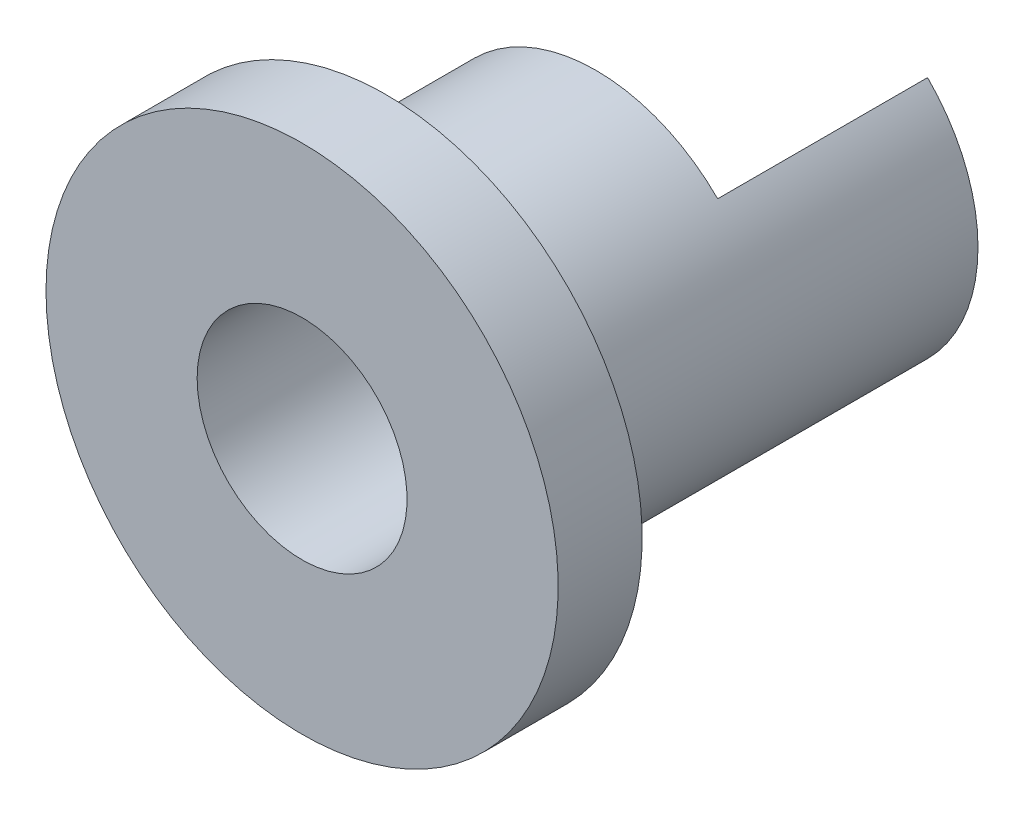
ISO-10303-21;
HEADER;
FILE_DESCRIPTION(('STEP AP214'),'2;1');
FILE_NAME('part.step','',(''),(''),'','','');
FILE_SCHEMA(('AUTOMOTIVE_DESIGN { 1 0 10303 214 1 1 1 1 }'));
ENDSEC;
DATA;
#1=APPLICATION_CONTEXT('core data for automotive mechanical design processes');
#2=APPLICATION_PROTOCOL_DEFINITION('international standard','automotive_design',2000,#1);
#3=PRODUCT_CONTEXT('',#1,'mechanical');
#4=PRODUCT('Part','Part','',(#3));
#5=PRODUCT_RELATED_PRODUCT_CATEGORY('part','',(#4));
#6=PRODUCT_DEFINITION_FORMATION('','',#4);
#7=PRODUCT_DEFINITION_CONTEXT('part definition',#1,'design');
#8=PRODUCT_DEFINITION('design','',#6,#7);
#9=PRODUCT_DEFINITION_SHAPE('','',#8);
#10=(LENGTH_UNIT() NAMED_UNIT(*) SI_UNIT(.MILLI.,.METRE.));
#11=(NAMED_UNIT(*) PLANE_ANGLE_UNIT() SI_UNIT($,.RADIAN.));
#12=(NAMED_UNIT(*) SI_UNIT($,.STERADIAN.) SOLID_ANGLE_UNIT());
#13=UNCERTAINTY_MEASURE_WITH_UNIT(LENGTH_MEASURE(1.E-05),#10,'distance_accuracy_value','');
#14=(GEOMETRIC_REPRESENTATION_CONTEXT(3) GLOBAL_UNCERTAINTY_ASSIGNED_CONTEXT((#13)) GLOBAL_UNIT_ASSIGNED_CONTEXT((#10,
#11,#12)) REPRESENTATION_CONTEXT('',''));
#15=CARTESIAN_POINT('',(0.,0.,0.));
#16=DIRECTION('',(0.,0.,1.));
#17=DIRECTION('',(1.,0.,0.));
#18=AXIS2_PLACEMENT_3D('',#15,#16,#17);
#19=CARTESIAN_POINT('',(0.,0.,-7.5974025974026));
#20=DIRECTION('',(0.,0.,-1.));
#21=DIRECTION('',(-1.,0.,0.));
#22=AXIS2_PLACEMENT_3D('',#19,#20,#21);
#23=CYLINDRICAL_SURFACE('',#22,2.5);
#24=CARTESIAN_POINT('',(0.,0.,-7.));
#25=DIRECTION('',(0.,0.,-1.));
#26=DIRECTION('',(-1.,0.,0.));
#27=AXIS2_PLACEMENT_3D('',#24,#25,#26);
#28=CIRCLE('',#27,2.5);
#29=CARTESIAN_POINT('',(1.76776695296637,-1.76776695296637,-7.));
#30=VERTEX_POINT('',#29);
#31=CARTESIAN_POINT('',(1.76776695296637,1.76776695296637,-7.));
#32=VERTEX_POINT('',#31);
#33=EDGE_CURVE('E94',#30,#32,#28,.T.);
#34=ORIENTED_EDGE('',*,*,#33,.T.);
#35=DIRECTION('',(0.,0.,1.));
#36=VECTOR('',#35,1.);
#37=CARTESIAN_POINT('',(1.76776695296637,1.76776695296637,-12.));
#38=LINE('',#37,#36);
#39=CARTESIAN_POINT('',(1.76776695296637,1.76776695296637,-12.));
#40=VERTEX_POINT('',#39);
#41=EDGE_CURVE('E97',#40,#32,#38,.T.);
#42=ORIENTED_EDGE('',*,*,#41,.F.);
#43=CARTESIAN_POINT('',(0.,0.,-12.));
#44=DIRECTION('',(0.,0.,1.));
#45=DIRECTION('',(-1.,0.,0.));
#46=AXIS2_PLACEMENT_3D('',#43,#44,#45);
#47=CIRCLE('',#46,2.5);
#48=CARTESIAN_POINT('',(1.76776695296636,-1.76776695296637,-12.));
#49=VERTEX_POINT('',#48);
#50=EDGE_CURVE('E81',#49,#40,#47,.T.);
#51=ORIENTED_EDGE('',*,*,#50,.F.);
#52=DIRECTION('',(0.,0.,1.));
#53=VECTOR('',#52,1.);
#54=CARTESIAN_POINT('',(1.76776695296636,-1.76776695296637,-12.));
#55=LINE('',#54,#53);
#56=EDGE_CURVE('E78',#49,#30,#55,.T.);
#57=ORIENTED_EDGE('',*,*,#56,.T.);
#58=EDGE_LOOP('',(#34,#42,#51,#57));
#59=FACE_BOUND('',#58,.T.);
#60=CARTESIAN_POINT('',(0.,0.,0.));
#61=DIRECTION('',(0.,0.,-1.));
#62=DIRECTION('',(-1.,0.,0.));
#63=AXIS2_PLACEMENT_3D('',#60,#61,#62);
#64=CIRCLE('',#63,2.5);
#65=CARTESIAN_POINT('',(-2.5,0.,0.));
#66=VERTEX_POINT('',#65);
#67=EDGE_CURVE('E11',#66,#66,#64,.T.);
#68=ORIENTED_EDGE('',*,*,#67,.F.);
#69=EDGE_LOOP('',(#68));
#70=FACE_BOUND('',#69,.T.);
#71=ADVANCED_FACE('F33',(#59,#70),#23,.F.);
#72=CARTESIAN_POINT('',(-2.5,0.,0.));
#73=DIRECTION('',(0.,0.,1.));
#74=DIRECTION('',(1.,0.,0.));
#75=AXIS2_PLACEMENT_3D('',#72,#73,#74);
#76=PLANE('',#75);
#77=ORIENTED_EDGE('',*,*,#67,.T.);
#78=EDGE_LOOP('',(#77));
#79=FACE_BOUND('',#78,.T.);
#80=CARTESIAN_POINT('',(0.,0.,0.));
#81=DIRECTION('',(0.,0.,-1.));
#82=DIRECTION('',(-1.,0.,0.));
#83=AXIS2_PLACEMENT_3D('',#80,#81,#82);
#84=CIRCLE('',#83,6.1);
#85=CARTESIAN_POINT('',(-6.1,0.,0.));
#86=VERTEX_POINT('',#85);
#87=EDGE_CURVE('E40',#86,#86,#84,.T.);
#88=ORIENTED_EDGE('',*,*,#87,.F.);
#89=EDGE_LOOP('',(#88));
#90=FACE_BOUND('',#89,.T.);
#91=ADVANCED_FACE('F113',(#79,#90),#76,.T.);
#92=CARTESIAN_POINT('',(0.,0.,-7.5974025974026));
#93=DIRECTION('',(0.,0.,-1.));
#94=DIRECTION('',(-1.,0.,0.));
#95=AXIS2_PLACEMENT_3D('',#92,#93,#94);
#96=CYLINDRICAL_SURFACE('',#95,6.1);
#97=ORIENTED_EDGE('',*,*,#87,.T.);
#98=EDGE_LOOP('',(#97));
#99=FACE_BOUND('',#98,.T.);
#100=CARTESIAN_POINT('',(0.,0.,-2.));
#101=DIRECTION('',(0.,0.,-1.));
#102=DIRECTION('',(-1.,0.,0.));
#103=AXIS2_PLACEMENT_3D('',#100,#101,#102);
#104=CIRCLE('',#103,6.1);
#105=CARTESIAN_POINT('',(-6.1,0.,-2.));
#106=VERTEX_POINT('',#105);
#107=EDGE_CURVE('E105',#106,#106,#104,.T.);
#108=ORIENTED_EDGE('',*,*,#107,.F.);
#109=EDGE_LOOP('',(#108));
#110=FACE_BOUND('',#109,.T.);
#111=ADVANCED_FACE('F110',(#99,#110),#96,.T.);
#112=CARTESIAN_POINT('',(-6.1,0.,-2.));
#113=DIRECTION('',(0.,0.,-1.));
#114=DIRECTION('',(-1.,0.,0.));
#115=AXIS2_PLACEMENT_3D('',#112,#113,#114);
#116=PLANE('',#115);
#117=ORIENTED_EDGE('',*,*,#107,.T.);
#118=EDGE_LOOP('',(#117));
#119=FACE_BOUND('',#118,.T.);
#120=CARTESIAN_POINT('',(0.,0.,-2.));
#121=DIRECTION('',(0.,0.,-1.));
#122=DIRECTION('',(-1.,0.,0.));
#123=AXIS2_PLACEMENT_3D('',#120,#121,#122);
#124=CIRCLE('',#123,4.1);
#125=CARTESIAN_POINT('',(-4.1,0.,-2.));
#126=VERTEX_POINT('',#125);
#127=EDGE_CURVE('E102',#126,#126,#124,.T.);
#128=ORIENTED_EDGE('',*,*,#127,.F.);
#129=EDGE_LOOP('',(#128));
#130=FACE_BOUND('',#129,.T.);
#131=ADVANCED_FACE('F119',(#119,#130),#116,.T.);
#132=CARTESIAN_POINT('',(0.,0.,-7.5974025974026));
#133=DIRECTION('',(0.,0.,-1.));
#134=DIRECTION('',(-1.,0.,0.));
#135=AXIS2_PLACEMENT_3D('',#132,#133,#134);
#136=CYLINDRICAL_SURFACE('',#135,4.1);
#137=ORIENTED_EDGE('',*,*,#127,.T.);
#138=EDGE_LOOP('',(#137));
#139=FACE_BOUND('',#138,.T.);
#140=CARTESIAN_POINT('',(0.,0.,-7.));
#141=DIRECTION('',(0.,0.,-1.));
#142=DIRECTION('',(-1.,0.,0.));
#143=AXIS2_PLACEMENT_3D('',#140,#141,#142);
#144=CIRCLE('',#143,4.1);
#145=CARTESIAN_POINT('',(2.89913780286484,-2.89913780286485,-7.));
#146=VERTEX_POINT('',#145);
#147=CARTESIAN_POINT('',(2.89913780286484,2.89913780286485,-7.));
#148=VERTEX_POINT('',#147);
#149=EDGE_CURVE('E93',#146,#148,#144,.T.);
#150=ORIENTED_EDGE('',*,*,#149,.F.);
#151=DIRECTION('',(0.,0.,1.));
#152=VECTOR('',#151,1.);
#153=CARTESIAN_POINT('',(2.89913780286484,-2.89913780286485,-12.));
#154=LINE('',#153,#152);
#155=CARTESIAN_POINT('',(2.89913780286484,-2.89913780286485,-12.));
#156=VERTEX_POINT('',#155);
#157=EDGE_CURVE('E76',#156,#146,#154,.T.);
#158=ORIENTED_EDGE('',*,*,#157,.F.);
#159=CARTESIAN_POINT('',(0.,0.,-12.));
#160=DIRECTION('',(0.,0.,-1.));
#161=DIRECTION('',(-1.,0.,0.));
#162=AXIS2_PLACEMENT_3D('',#159,#160,#161);
#163=CIRCLE('',#162,4.1);
#164=CARTESIAN_POINT('',(2.89913780286484,2.89913780286485,-12.));
#165=VERTEX_POINT('',#164);
#166=EDGE_CURVE('E82',#165,#156,#163,.T.);
#167=ORIENTED_EDGE('',*,*,#166,.F.);
#168=DIRECTION('',(0.,0.,1.));
#169=VECTOR('',#168,1.);
#170=CARTESIAN_POINT('',(2.89913780286484,2.89913780286485,-12.));
#171=LINE('',#170,#169);
#172=EDGE_CURVE('E199',#165,#148,#171,.T.);
#173=ORIENTED_EDGE('',*,*,#172,.T.);
#174=EDGE_LOOP('',(#150,#158,#167,#173));
#175=FACE_BOUND('',#174,.T.);
#176=ADVANCED_FACE('F92',(#139,#175),#136,.T.);
#177=CARTESIAN_POINT('',(-4.1,0.,-7.));
#178=DIRECTION('',(0.,0.,-1.));
#179=DIRECTION('',(-1.,0.,0.));
#180=AXIS2_PLACEMENT_3D('',#177,#178,#179);
#181=PLANE('',#180);
#182=DIRECTION('',(0.707106781186547,0.707106781186548,0.));
#183=VECTOR('',#182,1.);
#184=CARTESIAN_POINT('',(2.89913780286484,2.89913780286485,-7.));
#185=LINE('',#184,#183);
#186=EDGE_CURVE('E47',#32,#148,#185,.T.);
#187=ORIENTED_EDGE('',*,*,#186,.F.);
#188=ORIENTED_EDGE('',*,*,#33,.F.);
#189=DIRECTION('',(-0.707106781186546,0.707106781186549,0.));
#190=VECTOR('',#189,1.);
#191=CARTESIAN_POINT('',(1.76776695296637,-1.76776695296637,-7.));
#192=LINE('',#191,#190);
#193=EDGE_CURVE('E52',#146,#30,#192,.T.);
#194=ORIENTED_EDGE('',*,*,#193,.F.);
#195=ORIENTED_EDGE('',*,*,#149,.T.);
#196=EDGE_LOOP('',(#187,#188,#194,#195));
#197=FACE_BOUND('',#196,.T.);
#198=ADVANCED_FACE('F129',(#197),#181,.T.);
#199=CARTESIAN_POINT('',(1.76776695296636,-1.76776695296637,-12.));
#200=DIRECTION('',(0.707106781186549,0.707106781186546,0.));
#201=DIRECTION('',(-0.707106781186546,0.707106781186549,0.));
#202=AXIS2_PLACEMENT_3D('',#199,#200,#201);
#203=PLANE('',#202);
#204=ORIENTED_EDGE('',*,*,#193,.T.);
#205=ORIENTED_EDGE('',*,*,#56,.F.);
#206=DIRECTION('',(-0.707106781186546,0.707106781186549,0.));
#207=VECTOR('',#206,1.);
#208=CARTESIAN_POINT('',(1.76776695296636,-1.76776695296637,-12.));
#209=LINE('',#208,#207);
#210=EDGE_CURVE('E72',#156,#49,#209,.T.);
#211=ORIENTED_EDGE('',*,*,#210,.F.);
#212=ORIENTED_EDGE('',*,*,#157,.T.);
#213=EDGE_LOOP('',(#204,#205,#211,#212));
#214=FACE_BOUND('',#213,.T.);
#215=ADVANCED_FACE('F74',(#214),#203,.F.);
#216=CARTESIAN_POINT('',(2.89913780286484,2.89913780286485,-12.));
#217=DIRECTION('',(0.707106781186548,-0.707106781186547,0.));
#218=DIRECTION('',(0.707106781186547,0.707106781186548,0.));
#219=AXIS2_PLACEMENT_3D('',#216,#217,#218);
#220=PLANE('',#219);
#221=ORIENTED_EDGE('',*,*,#186,.T.);
#222=ORIENTED_EDGE('',*,*,#172,.F.);
#223=DIRECTION('',(0.707106781186547,0.707106781186548,0.));
#224=VECTOR('',#223,1.);
#225=CARTESIAN_POINT('',(2.89913780286484,2.89913780286485,-12.));
#226=LINE('',#225,#224);
#227=EDGE_CURVE('E87',#40,#165,#226,.T.);
#228=ORIENTED_EDGE('',*,*,#227,.F.);
#229=ORIENTED_EDGE('',*,*,#41,.T.);
#230=EDGE_LOOP('',(#221,#222,#228,#229));
#231=FACE_BOUND('',#230,.T.);
#232=ADVANCED_FACE('F135',(#231),#220,.F.);
#233=CARTESIAN_POINT('',(0.,0.,-12.));
#234=DIRECTION('',(0.,0.,-1.));
#235=DIRECTION('',(-1.,0.,0.));
#236=AXIS2_PLACEMENT_3D('',#233,#234,#235);
#237=PLANE('',#236);
#238=ORIENTED_EDGE('',*,*,#166,.T.);
#239=ORIENTED_EDGE('',*,*,#210,.T.);
#240=ORIENTED_EDGE('',*,*,#50,.T.);
#241=ORIENTED_EDGE('',*,*,#227,.T.);
#242=EDGE_LOOP('',(#238,#239,#240,#241));
#243=FACE_BOUND('',#242,.T.);
#244=ADVANCED_FACE('F85',(#243),#237,.T.);
#245=CLOSED_SHELL('',(#71,#91,#111,#131,#176,#198,#215,#232,#244));
#246=MANIFOLD_SOLID_BREP('B2',#245);
#247=ADVANCED_BREP_SHAPE_REPRESENTATION('',(#18,#246),#14);
#248=SHAPE_DEFINITION_REPRESENTATION(#9,#247);
ENDSEC;
END-ISO-10303-21;
